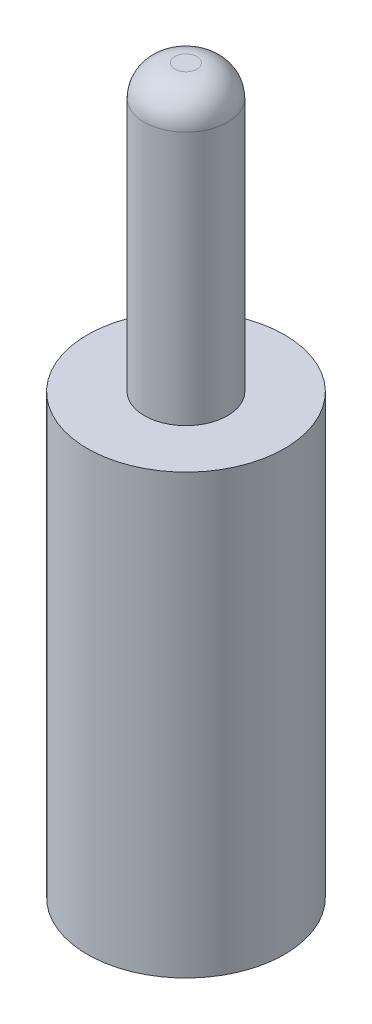
ISO-10303-21;
HEADER;
FILE_DESCRIPTION(('STEP AP214'),'2;1');
FILE_NAME('part.step','',(''),(''),'','','');
FILE_SCHEMA(('AUTOMOTIVE_DESIGN { 1 0 10303 214 1 1 1 1 }'));
ENDSEC;
DATA;
#1=APPLICATION_CONTEXT('core data for automotive mechanical design processes');
#2=APPLICATION_PROTOCOL_DEFINITION('international standard','automotive_design',2000,#1);
#3=PRODUCT_CONTEXT('',#1,'mechanical');
#4=PRODUCT('Part','Part','',(#3));
#5=PRODUCT_RELATED_PRODUCT_CATEGORY('part','',(#4));
#6=PRODUCT_DEFINITION_FORMATION('','',#4);
#7=PRODUCT_DEFINITION_CONTEXT('part definition',#1,'design');
#8=PRODUCT_DEFINITION('design','',#6,#7);
#9=PRODUCT_DEFINITION_SHAPE('','',#8);
#10=(LENGTH_UNIT() NAMED_UNIT(*) SI_UNIT(.MILLI.,.METRE.));
#11=(NAMED_UNIT(*) PLANE_ANGLE_UNIT() SI_UNIT($,.RADIAN.));
#12=(NAMED_UNIT(*) SI_UNIT($,.STERADIAN.) SOLID_ANGLE_UNIT());
#13=UNCERTAINTY_MEASURE_WITH_UNIT(LENGTH_MEASURE(1.E-05),#10,'distance_accuracy_value','');
#14=(GEOMETRIC_REPRESENTATION_CONTEXT(3) GLOBAL_UNCERTAINTY_ASSIGNED_CONTEXT((#13)) GLOBAL_UNIT_ASSIGNED_CONTEXT((#10,
#11,#12)) REPRESENTATION_CONTEXT('',''));
#15=CARTESIAN_POINT('',(0.,0.,0.));
#16=DIRECTION('',(0.,0.,1.));
#17=DIRECTION('',(1.,0.,0.));
#18=AXIS2_PLACEMENT_3D('',#15,#16,#17);
#19=CARTESIAN_POINT('',(0.,6.5,0.));
#20=DIRECTION('',(0.,-1.,0.));
#21=DIRECTION('',(0.,0.,-1.));
#22=AXIS2_PLACEMENT_3D('',#19,#20,#21);
#23=CYLINDRICAL_SURFACE('',#22,0.95);
#24=CARTESIAN_POINT('',(0.,5.8,0.));
#25=DIRECTION('',(0.,1.,0.));
#26=DIRECTION('',(0.,0.,1.));
#27=AXIS2_PLACEMENT_3D('',#24,#25,#26);
#28=CIRCLE('',#27,0.95);
#29=CARTESIAN_POINT('',(0.,5.8,0.95));
#30=VERTEX_POINT('',#29);
#31=EDGE_CURVE('E10',#30,#30,#28,.F.);
#32=ORIENTED_EDGE('',*,*,#31,.T.);
#33=EDGE_LOOP('',(#32));
#34=FACE_BOUND('',#33,.T.);
#35=CARTESIAN_POINT('',(0.,0.,0.));
#36=DIRECTION('',(0.,1.,0.));
#37=DIRECTION('',(0.,0.,1.));
#38=AXIS2_PLACEMENT_3D('',#35,#36,#37);
#39=CIRCLE('',#38,0.95);
#40=CARTESIAN_POINT('',(0.,0.,0.95));
#41=VERTEX_POINT('',#40);
#42=EDGE_CURVE('E52',#41,#41,#39,.T.);
#43=ORIENTED_EDGE('',*,*,#42,.T.);
#44=EDGE_LOOP('',(#43));
#45=FACE_BOUND('',#44,.T.);
#46=ADVANCED_FACE('F39',(#34,#45),#23,.T.);
#47=CARTESIAN_POINT('',(0.,6.5,0.));
#48=DIRECTION('',(0.,1.,0.));
#49=DIRECTION('',(0.,0.,1.));
#50=AXIS2_PLACEMENT_3D('',#47,#48,#49);
#51=PLANE('',#50);
#52=CARTESIAN_POINT('',(0.,6.5,0.));
#53=DIRECTION('',(0.,1.,0.));
#54=DIRECTION('',(0.,0.,1.));
#55=AXIS2_PLACEMENT_3D('',#52,#53,#54);
#56=CIRCLE('',#55,0.25);
#57=CARTESIAN_POINT('',(0.,6.5,0.25));
#58=VERTEX_POINT('',#57);
#59=EDGE_CURVE('E47',#58,#58,#56,.T.);
#60=ORIENTED_EDGE('',*,*,#59,.T.);
#61=EDGE_LOOP('',(#60));
#62=FACE_BOUND('',#61,.T.);
#63=ADVANCED_FACE('F73',(#62),#51,.T.);
#64=CARTESIAN_POINT('',(0.,-10.,0.));
#65=DIRECTION('',(0.,1.,0.));
#66=DIRECTION('',(0.,0.,1.));
#67=AXIS2_PLACEMENT_3D('',#64,#65,#66);
#68=CYLINDRICAL_SURFACE('',#67,2.25);
#69=CARTESIAN_POINT('',(0.,-10.,0.));
#70=DIRECTION('',(0.,-1.,0.));
#71=DIRECTION('',(0.,0.,-1.));
#72=AXIS2_PLACEMENT_3D('',#69,#70,#71);
#73=CIRCLE('',#72,2.25);
#74=CARTESIAN_POINT('',(0.,-10.,-2.25));
#75=VERTEX_POINT('',#74);
#76=EDGE_CURVE('E57',#75,#75,#73,.T.);
#77=ORIENTED_EDGE('',*,*,#76,.F.);
#78=EDGE_LOOP('',(#77));
#79=FACE_BOUND('',#78,.T.);
#80=CARTESIAN_POINT('',(0.,0.,0.));
#81=DIRECTION('',(0.,-1.,0.));
#82=DIRECTION('',(0.,0.,-1.));
#83=AXIS2_PLACEMENT_3D('',#80,#81,#82);
#84=CIRCLE('',#83,2.25);
#85=CARTESIAN_POINT('',(0.,0.,-2.25));
#86=VERTEX_POINT('',#85);
#87=EDGE_CURVE('E60',#86,#86,#84,.T.);
#88=ORIENTED_EDGE('',*,*,#87,.T.);
#89=EDGE_LOOP('',(#88));
#90=FACE_BOUND('',#89,.T.);
#91=ADVANCED_FACE('F70',(#79,#90),#68,.T.);
#92=CARTESIAN_POINT('',(0.,-10.,0.));
#93=DIRECTION('',(0.,-1.,0.));
#94=DIRECTION('',(0.,0.,-1.));
#95=AXIS2_PLACEMENT_3D('',#92,#93,#94);
#96=PLANE('',#95);
#97=ORIENTED_EDGE('',*,*,#76,.T.);
#98=EDGE_LOOP('',(#97));
#99=FACE_BOUND('',#98,.T.);
#100=ADVANCED_FACE('F68',(#99),#96,.T.);
#101=CARTESIAN_POINT('',(0.,0.,0.));
#102=DIRECTION('',(0.,-1.,0.));
#103=DIRECTION('',(0.,0.,-1.));
#104=AXIS2_PLACEMENT_3D('',#101,#102,#103);
#105=PLANE('',#104);
#106=ORIENTED_EDGE('',*,*,#42,.F.);
#107=EDGE_LOOP('',(#106));
#108=FACE_BOUND('',#107,.T.);
#109=ORIENTED_EDGE('',*,*,#87,.F.);
#110=EDGE_LOOP('',(#109));
#111=FACE_BOUND('',#110,.T.);
#112=ADVANCED_FACE('F77',(#108,#111),#105,.F.);
#113=CARTESIAN_POINT('',(0.,5.8,0.));
#114=DIRECTION('',(0.,1.,0.));
#115=DIRECTION('',(0.,0.,1.));
#116=AXIS2_PLACEMENT_3D('',#113,#114,#115);
#117=DEGENERATE_TOROIDAL_SURFACE('',#116,0.25,0.7,.T.);
#118=ORIENTED_EDGE('',*,*,#31,.F.);
#119=EDGE_LOOP('',(#118));
#120=FACE_BOUND('',#119,.T.);
#121=ORIENTED_EDGE('',*,*,#59,.F.);
#122=EDGE_LOOP('',(#121));
#123=FACE_BOUND('',#122,.T.);
#124=ADVANCED_FACE('F41',(#120,#123),#117,.T.);
#125=CLOSED_SHELL('',(#46,#63,#91,#100,#112,#124));
#126=MANIFOLD_SOLID_BREP('B2',#125);
#127=ADVANCED_BREP_SHAPE_REPRESENTATION('',(#18,#126),#14);
#128=SHAPE_DEFINITION_REPRESENTATION(#9,#127);
ENDSEC;
END-ISO-10303-21;
